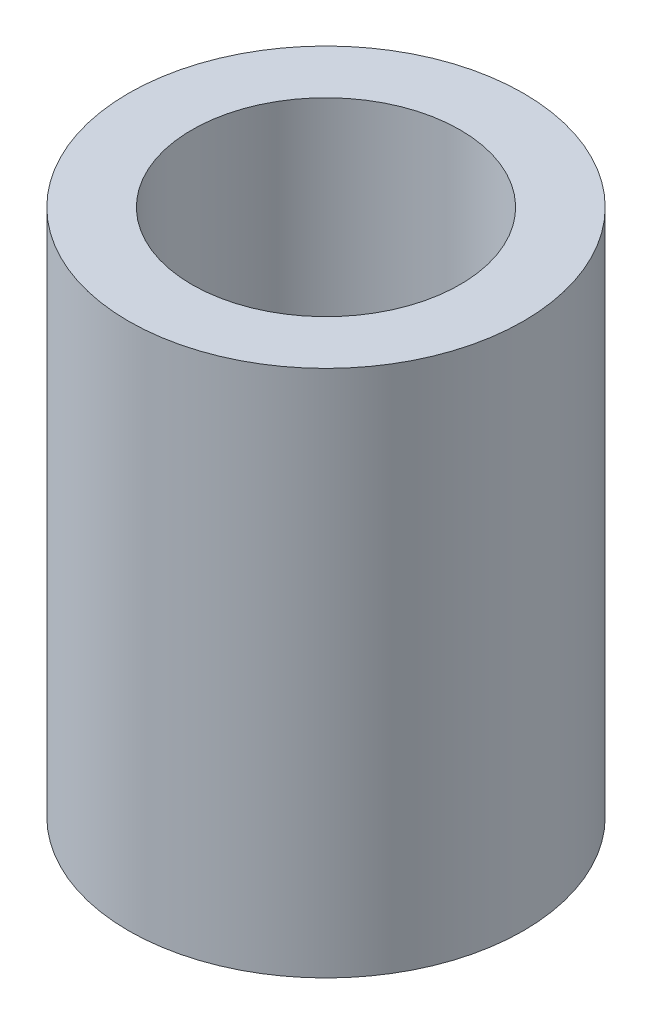
ISO-10303-21;
HEADER;
FILE_DESCRIPTION(('STEP AP214'),'2;1');
FILE_NAME('part.step','',(''),(''),'','','');
FILE_SCHEMA(('AUTOMOTIVE_DESIGN { 1 0 10303 214 1 1 1 1 }'));
ENDSEC;
DATA;
#1=APPLICATION_CONTEXT('core data for automotive mechanical design processes');
#2=APPLICATION_PROTOCOL_DEFINITION('international standard','automotive_design',2000,#1);
#3=PRODUCT_CONTEXT('',#1,'mechanical');
#4=PRODUCT('Part','Part','',(#3));
#5=PRODUCT_RELATED_PRODUCT_CATEGORY('part','',(#4));
#6=PRODUCT_DEFINITION_FORMATION('','',#4);
#7=PRODUCT_DEFINITION_CONTEXT('part definition',#1,'design');
#8=PRODUCT_DEFINITION('design','',#6,#7);
#9=PRODUCT_DEFINITION_SHAPE('','',#8);
#10=(LENGTH_UNIT() NAMED_UNIT(*) SI_UNIT(.MILLI.,.METRE.));
#11=(NAMED_UNIT(*) PLANE_ANGLE_UNIT() SI_UNIT($,.RADIAN.));
#12=(NAMED_UNIT(*) SI_UNIT($,.STERADIAN.) SOLID_ANGLE_UNIT());
#13=UNCERTAINTY_MEASURE_WITH_UNIT(LENGTH_MEASURE(1.E-05),#10,'distance_accuracy_value','');
#14=(GEOMETRIC_REPRESENTATION_CONTEXT(3) GLOBAL_UNCERTAINTY_ASSIGNED_CONTEXT((#13)) GLOBAL_UNIT_ASSIGNED_CONTEXT((#10,
#11,#12)) REPRESENTATION_CONTEXT('',''));
#15=CARTESIAN_POINT('',(0.,0.,0.));
#16=DIRECTION('',(0.,0.,1.));
#17=DIRECTION('',(1.,0.,0.));
#18=AXIS2_PLACEMENT_3D('',#15,#16,#17);
#19=CARTESIAN_POINT('',(-6.35,5.,0.));
#20=DIRECTION('',(0.,1.,0.));
#21=DIRECTION('',(0.,0.,1.));
#22=AXIS2_PLACEMENT_3D('',#19,#20,#21);
#23=PLANE('',#22);
#24=CARTESIAN_POINT('',(0.,5.,0.));
#25=DIRECTION('',(0.,1.,0.));
#26=DIRECTION('',(0.,0.,1.));
#27=AXIS2_PLACEMENT_3D('',#24,#25,#26);
#28=CIRCLE('',#27,6.35);
#29=CARTESIAN_POINT('',(0.,5.,6.35));
#30=VERTEX_POINT('',#29);
#31=EDGE_CURVE('E59',#30,#30,#28,.T.);
#32=ORIENTED_EDGE('',*,*,#31,.T.);
#33=EDGE_LOOP('',(#32));
#34=FACE_BOUND('',#33,.T.);
#35=CARTESIAN_POINT('',(0.,5.,0.));
#36=DIRECTION('',(0.,1.,0.));
#37=DIRECTION('',(0.,0.,1.));
#38=AXIS2_PLACEMENT_3D('',#35,#36,#37);
#39=CIRCLE('',#38,2.4);
#40=CARTESIAN_POINT('',(0.,5.,2.4));
#41=VERTEX_POINT('',#40);
#42=EDGE_CURVE('E10',#41,#41,#39,.T.);
#43=ORIENTED_EDGE('',*,*,#42,.F.);
#44=EDGE_LOOP('',(#43));
#45=FACE_BOUND('',#44,.T.);
#46=ADVANCED_FACE('F37',(#34,#45),#23,.T.);
#47=CARTESIAN_POINT('',(0.,0.,0.));
#48=DIRECTION('',(0.,1.,0.));
#49=DIRECTION('',(0.,0.,1.));
#50=AXIS2_PLACEMENT_3D('',#47,#48,#49);
#51=CYLINDRICAL_SURFACE('',#50,2.4);
#52=ORIENTED_EDGE('',*,*,#42,.T.);
#53=EDGE_LOOP('',(#52));
#54=FACE_BOUND('',#53,.T.);
#55=CARTESIAN_POINT('',(0.,0.,0.));
#56=DIRECTION('',(0.,1.,0.));
#57=DIRECTION('',(0.,0.,1.));
#58=AXIS2_PLACEMENT_3D('',#55,#56,#57);
#59=CIRCLE('',#58,2.4);
#60=CARTESIAN_POINT('',(0.,0.,2.4));
#61=VERTEX_POINT('',#60);
#62=EDGE_CURVE('E43',#61,#61,#59,.T.);
#63=ORIENTED_EDGE('',*,*,#62,.F.);
#64=EDGE_LOOP('',(#63));
#65=FACE_BOUND('',#64,.T.);
#66=ADVANCED_FACE('F77',(#54,#65),#51,.F.);
#67=CARTESIAN_POINT('',(-2.4,0.,0.));
#68=DIRECTION('',(0.,-1.,0.));
#69=DIRECTION('',(0.,0.,-1.));
#70=AXIS2_PLACEMENT_3D('',#67,#68,#69);
#71=PLANE('',#70);
#72=ORIENTED_EDGE('',*,*,#62,.T.);
#73=EDGE_LOOP('',(#72));
#74=FACE_BOUND('',#73,.T.);
#75=CARTESIAN_POINT('',(0.,0.,0.));
#76=DIRECTION('',(0.,1.,0.));
#77=DIRECTION('',(0.,0.,1.));
#78=AXIS2_PLACEMENT_3D('',#75,#76,#77);
#79=CIRCLE('',#78,9.35);
#80=CARTESIAN_POINT('',(0.,0.,9.35));
#81=VERTEX_POINT('',#80);
#82=EDGE_CURVE('E47',#81,#81,#79,.T.);
#83=ORIENTED_EDGE('',*,*,#82,.F.);
#84=EDGE_LOOP('',(#83));
#85=FACE_BOUND('',#84,.T.);
#86=ADVANCED_FACE('F81',(#74,#85),#71,.T.);
#87=CARTESIAN_POINT('',(0.,0.,0.));
#88=DIRECTION('',(0.,1.,0.));
#89=DIRECTION('',(0.,0.,1.));
#90=AXIS2_PLACEMENT_3D('',#87,#88,#89);
#91=CYLINDRICAL_SURFACE('',#90,9.35);
#92=ORIENTED_EDGE('',*,*,#82,.T.);
#93=EDGE_LOOP('',(#92));
#94=FACE_BOUND('',#93,.T.);
#95=CARTESIAN_POINT('',(0.,25.,0.));
#96=DIRECTION('',(0.,1.,0.));
#97=DIRECTION('',(0.,0.,1.));
#98=AXIS2_PLACEMENT_3D('',#95,#96,#97);
#99=CIRCLE('',#98,9.35);
#100=CARTESIAN_POINT('',(0.,25.,9.35));
#101=VERTEX_POINT('',#100);
#102=EDGE_CURVE('E51',#101,#101,#99,.T.);
#103=ORIENTED_EDGE('',*,*,#102,.F.);
#104=EDGE_LOOP('',(#103));
#105=FACE_BOUND('',#104,.T.);
#106=ADVANCED_FACE('F73',(#94,#105),#91,.T.);
#107=CARTESIAN_POINT('',(-9.35,25.,0.));
#108=DIRECTION('',(0.,1.,0.));
#109=DIRECTION('',(0.,0.,1.));
#110=AXIS2_PLACEMENT_3D('',#107,#108,#109);
#111=PLANE('',#110);
#112=ORIENTED_EDGE('',*,*,#102,.T.);
#113=EDGE_LOOP('',(#112));
#114=FACE_BOUND('',#113,.T.);
#115=CARTESIAN_POINT('',(0.,25.,0.));
#116=DIRECTION('',(0.,1.,0.));
#117=DIRECTION('',(0.,0.,1.));
#118=AXIS2_PLACEMENT_3D('',#115,#116,#117);
#119=CIRCLE('',#118,6.35);
#120=CARTESIAN_POINT('',(0.,25.,6.35));
#121=VERTEX_POINT('',#120);
#122=EDGE_CURVE('E56',#121,#121,#119,.T.);
#123=ORIENTED_EDGE('',*,*,#122,.F.);
#124=EDGE_LOOP('',(#123));
#125=FACE_BOUND('',#124,.T.);
#126=ADVANCED_FACE('F67',(#114,#125),#111,.T.);
#127=CARTESIAN_POINT('',(0.,0.,0.));
#128=DIRECTION('',(0.,1.,0.));
#129=DIRECTION('',(0.,0.,1.));
#130=AXIS2_PLACEMENT_3D('',#127,#128,#129);
#131=CYLINDRICAL_SURFACE('',#130,6.35);
#132=ORIENTED_EDGE('',*,*,#122,.T.);
#133=EDGE_LOOP('',(#132));
#134=FACE_BOUND('',#133,.T.);
#135=ORIENTED_EDGE('',*,*,#31,.F.);
#136=EDGE_LOOP('',(#135));
#137=FACE_BOUND('',#136,.T.);
#138=ADVANCED_FACE('F65',(#134,#137),#131,.F.);
#139=CLOSED_SHELL('',(#46,#66,#86,#106,#126,#138));
#140=MANIFOLD_SOLID_BREP('B2',#139);
#141=ADVANCED_BREP_SHAPE_REPRESENTATION('',(#18,#140),#14);
#142=SHAPE_DEFINITION_REPRESENTATION(#9,#141);
ENDSEC;
END-ISO-10303-21;
